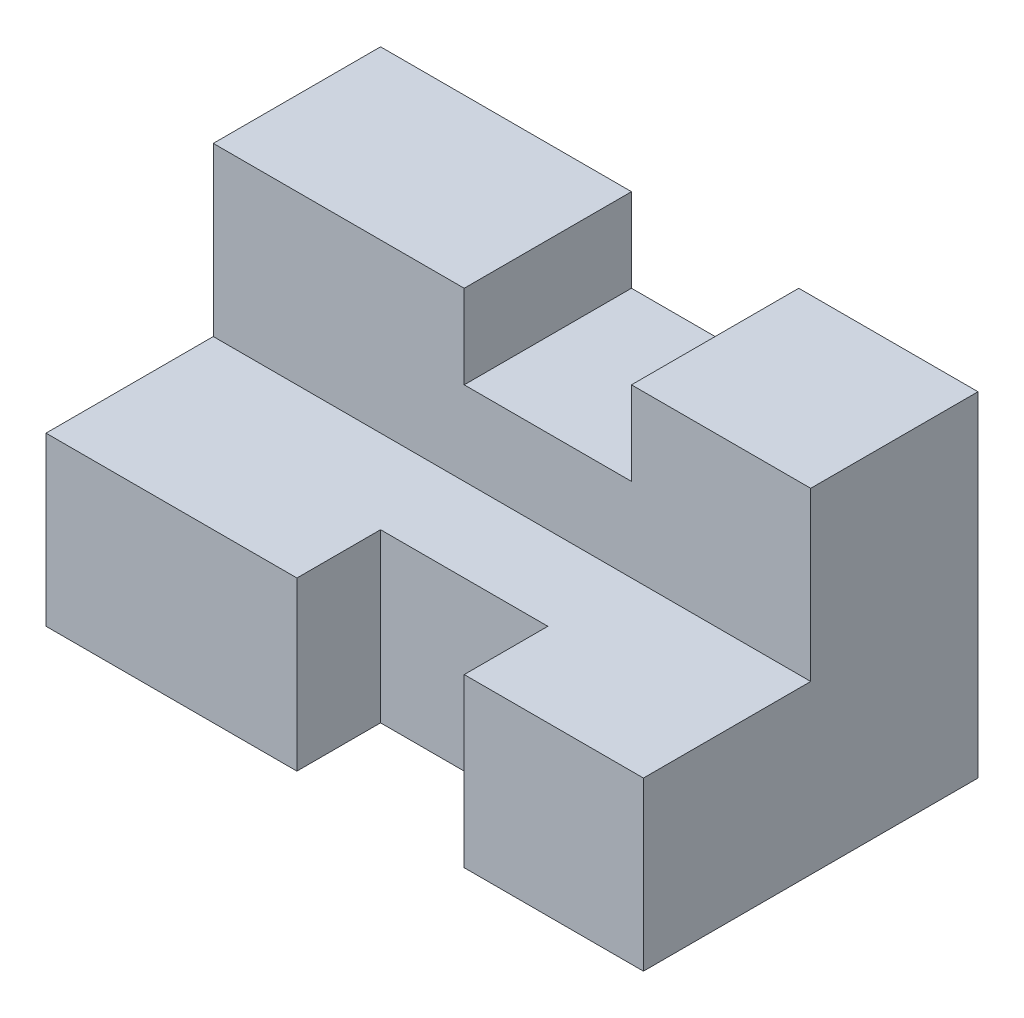
ISO-10303-21;
HEADER;
FILE_DESCRIPTION(('STEP AP214'),'2;1');
FILE_NAME('part.step','',(''),(''),'','','');
FILE_SCHEMA(('AUTOMOTIVE_DESIGN { 1 0 10303 214 1 1 1 1 }'));
ENDSEC;
DATA;
#1=APPLICATION_CONTEXT('core data for automotive mechanical design processes');
#2=APPLICATION_PROTOCOL_DEFINITION('international standard','automotive_design',2000,#1);
#3=PRODUCT_CONTEXT('',#1,'mechanical');
#4=PRODUCT('Part','Part','',(#3));
#5=PRODUCT_RELATED_PRODUCT_CATEGORY('part','',(#4));
#6=PRODUCT_DEFINITION_FORMATION('','',#4);
#7=PRODUCT_DEFINITION_CONTEXT('part definition',#1,'design');
#8=PRODUCT_DEFINITION('design','',#6,#7);
#9=PRODUCT_DEFINITION_SHAPE('','',#8);
#10=(LENGTH_UNIT() NAMED_UNIT(*) SI_UNIT(.MILLI.,.METRE.));
#11=(NAMED_UNIT(*) PLANE_ANGLE_UNIT() SI_UNIT($,.RADIAN.));
#12=(NAMED_UNIT(*) SI_UNIT($,.STERADIAN.) SOLID_ANGLE_UNIT());
#13=UNCERTAINTY_MEASURE_WITH_UNIT(LENGTH_MEASURE(1.E-05),#10,'distance_accuracy_value','');
#14=(GEOMETRIC_REPRESENTATION_CONTEXT(3) GLOBAL_UNCERTAINTY_ASSIGNED_CONTEXT((#13)) GLOBAL_UNIT_ASSIGNED_CONTEXT((#10,
#11,#12)) REPRESENTATION_CONTEXT('',''));
#15=CARTESIAN_POINT('',(0.,0.,0.));
#16=DIRECTION('',(0.,0.,1.));
#17=DIRECTION('',(1.,0.,0.));
#18=AXIS2_PLACEMENT_3D('',#15,#16,#17);
#19=CARTESIAN_POINT('',(25.,14.,28.));
#20=DIRECTION('',(0.,-1.,0.));
#21=DIRECTION('',(0.,0.,-1.));
#22=AXIS2_PLACEMENT_3D('',#19,#20,#21);
#23=PLANE('',#22);
#24=DIRECTION('',(0.,0.,1.));
#25=VECTOR('',#24,1.);
#26=CARTESIAN_POINT('',(10.,14.,0.));
#27=LINE('',#26,#25);
#28=CARTESIAN_POINT('',(10.,14.,21.));
#29=VERTEX_POINT('',#28);
#30=CARTESIAN_POINT('',(10.,14.,28.));
#31=VERTEX_POINT('',#30);
#32=EDGE_CURVE('E215',#29,#31,#27,.T.);
#33=ORIENTED_EDGE('',*,*,#32,.T.);
#34=DIRECTION('',(-1.,0.,0.));
#35=VECTOR('',#34,1.);
#36=CARTESIAN_POINT('',(25.,14.,28.));
#37=LINE('',#36,#35);
#38=CARTESIAN_POINT('',(25.,14.,28.));
#39=VERTEX_POINT('',#38);
#40=EDGE_CURVE('E11',#39,#31,#37,.T.);
#41=ORIENTED_EDGE('',*,*,#40,.F.);
#42=DIRECTION('',(0.,0.,1.));
#43=VECTOR('',#42,1.);
#44=CARTESIAN_POINT('',(25.,14.,28.));
#45=LINE('',#44,#43);
#46=CARTESIAN_POINT('',(25.,14.,14.));
#47=VERTEX_POINT('',#46);
#48=EDGE_CURVE('E89',#47,#39,#45,.T.);
#49=ORIENTED_EDGE('',*,*,#48,.F.);
#50=DIRECTION('',(-1.,0.,0.));
#51=VECTOR('',#50,1.);
#52=CARTESIAN_POINT('',(25.,14.,14.));
#53=LINE('',#52,#51);
#54=CARTESIAN_POINT('',(-25.,14.,14.));
#55=VERTEX_POINT('',#54);
#56=EDGE_CURVE('E208',#47,#55,#53,.T.);
#57=ORIENTED_EDGE('',*,*,#56,.T.);
#58=DIRECTION('',(0.,0.,1.));
#59=VECTOR('',#58,1.);
#60=CARTESIAN_POINT('',(-25.,14.,28.));
#61=LINE('',#60,#59);
#62=CARTESIAN_POINT('',(-25.,14.,28.));
#63=VERTEX_POINT('',#62);
#64=EDGE_CURVE('E235',#55,#63,#61,.T.);
#65=ORIENTED_EDGE('',*,*,#64,.T.);
#66=CARTESIAN_POINT('',(-4.,14.,28.));
#67=VERTEX_POINT('',#66);
#68=EDGE_CURVE('E46',#67,#63,#37,.T.);
#69=ORIENTED_EDGE('',*,*,#68,.F.);
#70=DIRECTION('',(0.,0.,-1.));
#71=VECTOR('',#70,1.);
#72=CARTESIAN_POINT('',(-4.,14.,0.));
#73=LINE('',#72,#71);
#74=CARTESIAN_POINT('',(-4.,14.,21.));
#75=VERTEX_POINT('',#74);
#76=EDGE_CURVE('E221',#67,#75,#73,.T.);
#77=ORIENTED_EDGE('',*,*,#76,.T.);
#78=DIRECTION('',(1.,0.,0.));
#79=VECTOR('',#78,1.);
#80=CARTESIAN_POINT('',(0.,14.,21.));
#81=LINE('',#80,#79);
#82=EDGE_CURVE('E218',#75,#29,#81,.T.);
#83=ORIENTED_EDGE('',*,*,#82,.T.);
#84=EDGE_LOOP('',(#33,#41,#49,#57,#65,#69,#77,#83));
#85=FACE_BOUND('',#84,.T.);
#86=ADVANCED_FACE('F39',(#85),#23,.F.);
#87=CARTESIAN_POINT('',(25.,0.,28.));
#88=DIRECTION('',(0.,0.,-1.));
#89=DIRECTION('',(-1.,0.,0.));
#90=AXIS2_PLACEMENT_3D('',#87,#88,#89);
#91=PLANE('',#90);
#92=DIRECTION('',(0.,1.,0.));
#93=VECTOR('',#92,1.);
#94=CARTESIAN_POINT('',(10.,-0.000999999999999265,28.));
#95=LINE('',#94,#93);
#96=CARTESIAN_POINT('',(10.,0.,28.));
#97=VERTEX_POINT('',#96);
#98=EDGE_CURVE('E225',#97,#31,#95,.T.);
#99=ORIENTED_EDGE('',*,*,#98,.F.);
#100=DIRECTION('',(-1.,0.,0.));
#101=VECTOR('',#100,1.);
#102=CARTESIAN_POINT('',(25.,0.,28.));
#103=LINE('',#102,#101);
#104=CARTESIAN_POINT('',(25.,0.,28.));
#105=VERTEX_POINT('',#104);
#106=EDGE_CURVE('E245',#105,#97,#103,.T.);
#107=ORIENTED_EDGE('',*,*,#106,.F.);
#108=DIRECTION('',(0.,-1.,0.));
#109=VECTOR('',#108,1.);
#110=CARTESIAN_POINT('',(25.,0.,28.));
#111=LINE('',#110,#109);
#112=EDGE_CURVE('E237',#39,#105,#111,.T.);
#113=ORIENTED_EDGE('',*,*,#112,.F.);
#114=ORIENTED_EDGE('',*,*,#40,.T.);
#115=EDGE_LOOP('',(#99,#107,#113,#114));
#116=FACE_BOUND('',#115,.T.);
#117=ADVANCED_FACE('F287',(#116),#91,.F.);
#118=DIRECTION('',(0.,1.,0.));
#119=VECTOR('',#118,1.);
#120=CARTESIAN_POINT('',(-4.,-0.000999999999999265,28.));
#121=LINE('',#120,#119);
#122=CARTESIAN_POINT('',(-4.,0.,28.));
#123=VERTEX_POINT('',#122);
#124=EDGE_CURVE('E228',#123,#67,#121,.T.);
#125=ORIENTED_EDGE('',*,*,#124,.T.);
#126=ORIENTED_EDGE('',*,*,#68,.T.);
#127=DIRECTION('',(0.,-1.,0.));
#128=VECTOR('',#127,1.);
#129=CARTESIAN_POINT('',(-25.,0.,28.));
#130=LINE('',#129,#128);
#131=CARTESIAN_POINT('',(-25.,0.,28.));
#132=VERTEX_POINT('',#131);
#133=EDGE_CURVE('E243',#63,#132,#130,.T.);
#134=ORIENTED_EDGE('',*,*,#133,.T.);
#135=EDGE_CURVE('E81',#123,#132,#103,.T.);
#136=ORIENTED_EDGE('',*,*,#135,.F.);
#137=EDGE_LOOP('',(#125,#126,#134,#136));
#138=FACE_BOUND('',#137,.T.);
#139=ADVANCED_FACE('F250',(#138),#91,.F.);
#140=CARTESIAN_POINT('',(25.,0.,0.));
#141=DIRECTION('',(0.,1.,0.));
#142=DIRECTION('',(0.,0.,1.));
#143=AXIS2_PLACEMENT_3D('',#140,#141,#142);
#144=PLANE('',#143);
#145=DIRECTION('',(0.,0.,-1.));
#146=VECTOR('',#145,1.);
#147=CARTESIAN_POINT('',(10.,0.,0.));
#148=LINE('',#147,#146);
#149=CARTESIAN_POINT('',(10.,0.,21.));
#150=VERTEX_POINT('',#149);
#151=EDGE_CURVE('E212',#97,#150,#148,.T.);
#152=ORIENTED_EDGE('',*,*,#151,.T.);
#153=DIRECTION('',(-1.,0.,0.));
#154=VECTOR('',#153,1.);
#155=CARTESIAN_POINT('',(0.,0.,21.));
#156=LINE('',#155,#154);
#157=CARTESIAN_POINT('',(-4.,0.,21.));
#158=VERTEX_POINT('',#157);
#159=EDGE_CURVE('E227',#150,#158,#156,.T.);
#160=ORIENTED_EDGE('',*,*,#159,.T.);
#161=DIRECTION('',(0.,0.,1.));
#162=VECTOR('',#161,1.);
#163=CARTESIAN_POINT('',(-4.,0.,0.));
#164=LINE('',#163,#162);
#165=EDGE_CURVE('E210',#158,#123,#164,.T.);
#166=ORIENTED_EDGE('',*,*,#165,.T.);
#167=ORIENTED_EDGE('',*,*,#135,.T.);
#168=DIRECTION('',(0.,0.,-1.));
#169=VECTOR('',#168,1.);
#170=CARTESIAN_POINT('',(-25.,0.,0.));
#171=LINE('',#170,#169);
#172=CARTESIAN_POINT('',(-25.,0.,0.));
#173=VERTEX_POINT('',#172);
#174=EDGE_CURVE('E238',#132,#173,#171,.T.);
#175=ORIENTED_EDGE('',*,*,#174,.T.);
#176=DIRECTION('',(-1.,0.,0.));
#177=VECTOR('',#176,1.);
#178=CARTESIAN_POINT('',(25.,0.,0.));
#179=LINE('',#178,#177);
#180=CARTESIAN_POINT('',(25.,0.,0.));
#181=VERTEX_POINT('',#180);
#182=EDGE_CURVE('E196',#181,#173,#179,.T.);
#183=ORIENTED_EDGE('',*,*,#182,.F.);
#184=DIRECTION('',(0.,0.,-1.));
#185=VECTOR('',#184,1.);
#186=CARTESIAN_POINT('',(25.,0.,0.));
#187=LINE('',#186,#185);
#188=EDGE_CURVE('E62',#105,#181,#187,.T.);
#189=ORIENTED_EDGE('',*,*,#188,.F.);
#190=ORIENTED_EDGE('',*,*,#106,.T.);
#191=EDGE_LOOP('',(#152,#160,#166,#167,#175,#183,#189,#190));
#192=FACE_BOUND('',#191,.T.);
#193=ADVANCED_FACE('F257',(#192),#144,.F.);
#194=CARTESIAN_POINT('',(25.,0.,0.));
#195=DIRECTION('',(-1.,0.,0.));
#196=DIRECTION('',(0.,0.,1.));
#197=AXIS2_PLACEMENT_3D('',#194,#195,#196);
#198=PLANE('',#197);
#199=ORIENTED_EDGE('',*,*,#188,.T.);
#200=DIRECTION('',(0.,-1.,0.));
#201=VECTOR('',#200,1.);
#202=CARTESIAN_POINT('',(25.,0.,0.));
#203=LINE('',#202,#201);
#204=CARTESIAN_POINT('',(25.,28.,0.));
#205=VERTEX_POINT('',#204);
#206=EDGE_CURVE('E194',#205,#181,#203,.T.);
#207=ORIENTED_EDGE('',*,*,#206,.F.);
#208=DIRECTION('',(0.,0.,-1.));
#209=VECTOR('',#208,1.);
#210=CARTESIAN_POINT('',(25.,28.,0.));
#211=LINE('',#210,#209);
#212=CARTESIAN_POINT('',(25.,28.,14.));
#213=VERTEX_POINT('',#212);
#214=EDGE_CURVE('E169',#213,#205,#211,.T.);
#215=ORIENTED_EDGE('',*,*,#214,.F.);
#216=DIRECTION('',(0.,1.,0.));
#217=VECTOR('',#216,1.);
#218=CARTESIAN_POINT('',(25.,28.,14.));
#219=LINE('',#218,#217);
#220=EDGE_CURVE('E189',#47,#213,#219,.T.);
#221=ORIENTED_EDGE('',*,*,#220,.F.);
#222=ORIENTED_EDGE('',*,*,#48,.T.);
#223=ORIENTED_EDGE('',*,*,#112,.T.);
#224=EDGE_LOOP('',(#199,#207,#215,#221,#222,#223));
#225=FACE_BOUND('',#224,.T.);
#226=ADVANCED_FACE('F258',(#225),#198,.F.);
#227=CARTESIAN_POINT('',(-25.,0.,0.));
#228=DIRECTION('',(-1.,0.,0.));
#229=DIRECTION('',(0.,0.,1.));
#230=AXIS2_PLACEMENT_3D('',#227,#228,#229);
#231=PLANE('',#230);
#232=ORIENTED_EDGE('',*,*,#64,.F.);
#233=DIRECTION('',(0.,1.,0.));
#234=VECTOR('',#233,1.);
#235=CARTESIAN_POINT('',(-25.,28.,14.));
#236=LINE('',#235,#234);
#237=CARTESIAN_POINT('',(-25.,28.,14.));
#238=VERTEX_POINT('',#237);
#239=EDGE_CURVE('E178',#55,#238,#236,.T.);
#240=ORIENTED_EDGE('',*,*,#239,.T.);
#241=DIRECTION('',(0.,0.,-1.));
#242=VECTOR('',#241,1.);
#243=CARTESIAN_POINT('',(-25.,28.,0.));
#244=LINE('',#243,#242);
#245=CARTESIAN_POINT('',(-25.,28.,0.));
#246=VERTEX_POINT('',#245);
#247=EDGE_CURVE('E199',#238,#246,#244,.T.);
#248=ORIENTED_EDGE('',*,*,#247,.T.);
#249=DIRECTION('',(0.,-1.,0.));
#250=VECTOR('',#249,1.);
#251=CARTESIAN_POINT('',(-25.,0.,0.));
#252=LINE('',#251,#250);
#253=EDGE_CURVE('E192',#246,#173,#252,.T.);
#254=ORIENTED_EDGE('',*,*,#253,.T.);
#255=ORIENTED_EDGE('',*,*,#174,.F.);
#256=ORIENTED_EDGE('',*,*,#133,.F.);
#257=EDGE_LOOP('',(#232,#240,#248,#254,#255,#256));
#258=FACE_BOUND('',#257,.T.);
#259=ADVANCED_FACE('F256',(#258),#231,.T.);
#260=CARTESIAN_POINT('',(10.,-0.000999999999999265,0.));
#261=DIRECTION('',(-1.,0.,0.));
#262=DIRECTION('',(0.,0.,1.));
#263=AXIS2_PLACEMENT_3D('',#260,#261,#262);
#264=PLANE('',#263);
#265=ORIENTED_EDGE('',*,*,#98,.T.);
#266=ORIENTED_EDGE('',*,*,#32,.F.);
#267=DIRECTION('',(0.,1.,0.));
#268=VECTOR('',#267,1.);
#269=CARTESIAN_POINT('',(10.,-0.000999999999999265,21.));
#270=LINE('',#269,#268);
#271=EDGE_CURVE('E224',#150,#29,#270,.T.);
#272=ORIENTED_EDGE('',*,*,#271,.F.);
#273=ORIENTED_EDGE('',*,*,#151,.F.);
#274=EDGE_LOOP('',(#265,#266,#272,#273));
#275=FACE_BOUND('',#274,.T.);
#276=ADVANCED_FACE('F304',(#275),#264,.T.);
#277=CARTESIAN_POINT('',(-4.,-0.000999999999999265,0.));
#278=DIRECTION('',(1.,0.,0.));
#279=DIRECTION('',(0.,0.,-1.));
#280=AXIS2_PLACEMENT_3D('',#277,#278,#279);
#281=PLANE('',#280);
#282=DIRECTION('',(0.,1.,0.));
#283=VECTOR('',#282,1.);
#284=CARTESIAN_POINT('',(-4.,-0.000999999999999265,21.));
#285=LINE('',#284,#283);
#286=EDGE_CURVE('E53',#158,#75,#285,.T.);
#287=ORIENTED_EDGE('',*,*,#286,.T.);
#288=ORIENTED_EDGE('',*,*,#76,.F.);
#289=ORIENTED_EDGE('',*,*,#124,.F.);
#290=ORIENTED_EDGE('',*,*,#165,.F.);
#291=EDGE_LOOP('',(#287,#288,#289,#290));
#292=FACE_BOUND('',#291,.T.);
#293=ADVANCED_FACE('F309',(#292),#281,.T.);
#294=CARTESIAN_POINT('',(0.,-0.000999999999999265,21.));
#295=DIRECTION('',(0.,0.,1.));
#296=DIRECTION('',(1.,0.,0.));
#297=AXIS2_PLACEMENT_3D('',#294,#295,#296);
#298=PLANE('',#297);
#299=ORIENTED_EDGE('',*,*,#271,.T.);
#300=ORIENTED_EDGE('',*,*,#82,.F.);
#301=ORIENTED_EDGE('',*,*,#286,.F.);
#302=ORIENTED_EDGE('',*,*,#159,.F.);
#303=EDGE_LOOP('',(#299,#300,#301,#302));
#304=FACE_BOUND('',#303,.T.);
#305=ADVANCED_FACE('F311',(#304),#298,.T.);
#306=CARTESIAN_POINT('',(25.,28.,14.));
#307=DIRECTION('',(0.,0.,-1.));
#308=DIRECTION('',(0.,-1.,0.));
#309=AXIS2_PLACEMENT_3D('',#306,#307,#308);
#310=PLANE('',#309);
#311=DIRECTION('',(0.,1.,0.));
#312=VECTOR('',#311,1.);
#313=CARTESIAN_POINT('',(10.,0.,14.));
#314=LINE('',#313,#312);
#315=CARTESIAN_POINT('',(10.,21.,14.));
#316=VERTEX_POINT('',#315);
#317=CARTESIAN_POINT('',(10.,28.,14.));
#318=VERTEX_POINT('',#317);
#319=EDGE_CURVE('E161',#316,#318,#314,.T.);
#320=ORIENTED_EDGE('',*,*,#319,.F.);
#321=DIRECTION('',(1.,0.,0.));
#322=VECTOR('',#321,1.);
#323=CARTESIAN_POINT('',(0.,21.,14.));
#324=LINE('',#323,#322);
#325=CARTESIAN_POINT('',(-4.,21.,14.));
#326=VERTEX_POINT('',#325);
#327=EDGE_CURVE('E272',#326,#316,#324,.T.);
#328=ORIENTED_EDGE('',*,*,#327,.F.);
#329=DIRECTION('',(0.,-1.,0.));
#330=VECTOR('',#329,1.);
#331=CARTESIAN_POINT('',(-4.,0.,14.));
#332=LINE('',#331,#330);
#333=CARTESIAN_POINT('',(-4.,28.,14.));
#334=VERTEX_POINT('',#333);
#335=EDGE_CURVE('E183',#334,#326,#332,.T.);
#336=ORIENTED_EDGE('',*,*,#335,.F.);
#337=DIRECTION('',(-1.,0.,0.));
#338=VECTOR('',#337,1.);
#339=CARTESIAN_POINT('',(25.,28.,14.));
#340=LINE('',#339,#338);
#341=EDGE_CURVE('E170',#334,#238,#340,.T.);
#342=ORIENTED_EDGE('',*,*,#341,.T.);
#343=ORIENTED_EDGE('',*,*,#239,.F.);
#344=ORIENTED_EDGE('',*,*,#56,.F.);
#345=ORIENTED_EDGE('',*,*,#220,.T.);
#346=EDGE_CURVE('E206',#213,#318,#340,.T.);
#347=ORIENTED_EDGE('',*,*,#346,.T.);
#348=EDGE_LOOP('',(#320,#328,#336,#342,#343,#344,#345,#347));
#349=FACE_BOUND('',#348,.T.);
#350=ADVANCED_FACE('F260',(#349),#310,.F.);
#351=CARTESIAN_POINT('',(25.,28.,0.));
#352=DIRECTION('',(0.,-1.,0.));
#353=DIRECTION('',(-1.,0.,0.));
#354=AXIS2_PLACEMENT_3D('',#351,#352,#353);
#355=PLANE('',#354);
#356=DIRECTION('',(0.,0.,1.));
#357=VECTOR('',#356,1.);
#358=CARTESIAN_POINT('',(10.,28.,-0.000999999999993048));
#359=LINE('',#358,#357);
#360=CARTESIAN_POINT('',(10.,28.,0.));
#361=VERTEX_POINT('',#360);
#362=EDGE_CURVE('E167',#361,#318,#359,.T.);
#363=ORIENTED_EDGE('',*,*,#362,.T.);
#364=ORIENTED_EDGE('',*,*,#346,.F.);
#365=ORIENTED_EDGE('',*,*,#214,.T.);
#366=DIRECTION('',(-1.,0.,0.));
#367=VECTOR('',#366,1.);
#368=CARTESIAN_POINT('',(25.,28.,0.));
#369=LINE('',#368,#367);
#370=EDGE_CURVE('E154',#205,#361,#369,.T.);
#371=ORIENTED_EDGE('',*,*,#370,.T.);
#372=EDGE_LOOP('',(#363,#364,#365,#371));
#373=FACE_BOUND('',#372,.T.);
#374=ADVANCED_FACE('F165',(#373),#355,.F.);
#375=DIRECTION('',(0.,0.,1.));
#376=VECTOR('',#375,1.);
#377=CARTESIAN_POINT('',(-4.,28.,-0.000999999999993048));
#378=LINE('',#377,#376);
#379=CARTESIAN_POINT('',(-4.,28.,0.));
#380=VERTEX_POINT('',#379);
#381=EDGE_CURVE('E176',#380,#334,#378,.T.);
#382=ORIENTED_EDGE('',*,*,#381,.F.);
#383=EDGE_CURVE('E171',#380,#246,#369,.T.);
#384=ORIENTED_EDGE('',*,*,#383,.T.);
#385=ORIENTED_EDGE('',*,*,#247,.F.);
#386=ORIENTED_EDGE('',*,*,#341,.F.);
#387=EDGE_LOOP('',(#382,#384,#385,#386));
#388=FACE_BOUND('',#387,.T.);
#389=ADVANCED_FACE('F268',(#388),#355,.F.);
#390=CARTESIAN_POINT('',(25.,0.,0.));
#391=DIRECTION('',(0.,0.,1.));
#392=DIRECTION('',(0.,1.,0.));
#393=AXIS2_PLACEMENT_3D('',#390,#391,#392);
#394=PLANE('',#393);
#395=DIRECTION('',(0.,-1.,0.));
#396=VECTOR('',#395,1.);
#397=CARTESIAN_POINT('',(10.,0.,0.));
#398=LINE('',#397,#396);
#399=CARTESIAN_POINT('',(10.,21.,0.));
#400=VERTEX_POINT('',#399);
#401=EDGE_CURVE('E150',#361,#400,#398,.T.);
#402=ORIENTED_EDGE('',*,*,#401,.F.);
#403=ORIENTED_EDGE('',*,*,#370,.F.);
#404=ORIENTED_EDGE('',*,*,#206,.T.);
#405=ORIENTED_EDGE('',*,*,#182,.T.);
#406=ORIENTED_EDGE('',*,*,#253,.F.);
#407=ORIENTED_EDGE('',*,*,#383,.F.);
#408=DIRECTION('',(0.,1.,0.));
#409=VECTOR('',#408,1.);
#410=CARTESIAN_POINT('',(-4.,0.,0.));
#411=LINE('',#410,#409);
#412=CARTESIAN_POINT('',(-4.,21.,0.));
#413=VERTEX_POINT('',#412);
#414=EDGE_CURVE('E162',#413,#380,#411,.T.);
#415=ORIENTED_EDGE('',*,*,#414,.F.);
#416=DIRECTION('',(-1.,0.,0.));
#417=VECTOR('',#416,1.);
#418=CARTESIAN_POINT('',(0.,21.,0.));
#419=LINE('',#418,#417);
#420=EDGE_CURVE('E158',#400,#413,#419,.T.);
#421=ORIENTED_EDGE('',*,*,#420,.F.);
#422=EDGE_LOOP('',(#402,#403,#404,#405,#406,#407,#415,#421));
#423=FACE_BOUND('',#422,.T.);
#424=ADVANCED_FACE('F152',(#423),#394,.F.);
#425=CARTESIAN_POINT('',(10.,0.,-0.000999999999999265));
#426=DIRECTION('',(-1.,0.,0.));
#427=DIRECTION('',(0.,1.,0.));
#428=AXIS2_PLACEMENT_3D('',#425,#426,#427);
#429=PLANE('',#428);
#430=ORIENTED_EDGE('',*,*,#362,.F.);
#431=ORIENTED_EDGE('',*,*,#401,.T.);
#432=DIRECTION('',(0.,0.,1.));
#433=VECTOR('',#432,1.);
#434=CARTESIAN_POINT('',(10.,21.,-0.000999999999994602));
#435=LINE('',#434,#433);
#436=EDGE_CURVE('E187',#400,#316,#435,.T.);
#437=ORIENTED_EDGE('',*,*,#436,.T.);
#438=ORIENTED_EDGE('',*,*,#319,.T.);
#439=EDGE_LOOP('',(#430,#431,#437,#438));
#440=FACE_BOUND('',#439,.T.);
#441=ADVANCED_FACE('F174',(#440),#429,.T.);
#442=CARTESIAN_POINT('',(-4.,0.,-0.000999999999999265));
#443=DIRECTION('',(1.,0.,0.));
#444=DIRECTION('',(0.,-1.,0.));
#445=AXIS2_PLACEMENT_3D('',#442,#443,#444);
#446=PLANE('',#445);
#447=DIRECTION('',(0.,0.,1.));
#448=VECTOR('',#447,1.);
#449=CARTESIAN_POINT('',(-4.,21.,-0.000999999999994602));
#450=LINE('',#449,#448);
#451=EDGE_CURVE('E180',#413,#326,#450,.T.);
#452=ORIENTED_EDGE('',*,*,#451,.F.);
#453=ORIENTED_EDGE('',*,*,#414,.T.);
#454=ORIENTED_EDGE('',*,*,#381,.T.);
#455=ORIENTED_EDGE('',*,*,#335,.T.);
#456=EDGE_LOOP('',(#452,#453,#454,#455));
#457=FACE_BOUND('',#456,.T.);
#458=ADVANCED_FACE('F277',(#457),#446,.T.);
#459=CARTESIAN_POINT('',(0.,21.,-0.000999999999994602));
#460=DIRECTION('',(0.,1.,0.));
#461=DIRECTION('',(1.,0.,0.));
#462=AXIS2_PLACEMENT_3D('',#459,#460,#461);
#463=PLANE('',#462);
#464=ORIENTED_EDGE('',*,*,#436,.F.);
#465=ORIENTED_EDGE('',*,*,#420,.T.);
#466=ORIENTED_EDGE('',*,*,#451,.T.);
#467=ORIENTED_EDGE('',*,*,#327,.T.);
#468=EDGE_LOOP('',(#464,#465,#466,#467));
#469=FACE_BOUND('',#468,.T.);
#470=ADVANCED_FACE('F278',(#469),#463,.T.);
#471=CLOSED_SHELL('',(#86,#117,#139,#193,#226,#259,#276,#293,#305,#350,#374,#389,#424,#441,#458,#470));
#472=MANIFOLD_SOLID_BREP('B2',#471);
#473=ADVANCED_BREP_SHAPE_REPRESENTATION('',(#18,#472),#14);
#474=SHAPE_DEFINITION_REPRESENTATION(#9,#473);
ENDSEC;
END-ISO-10303-21;
